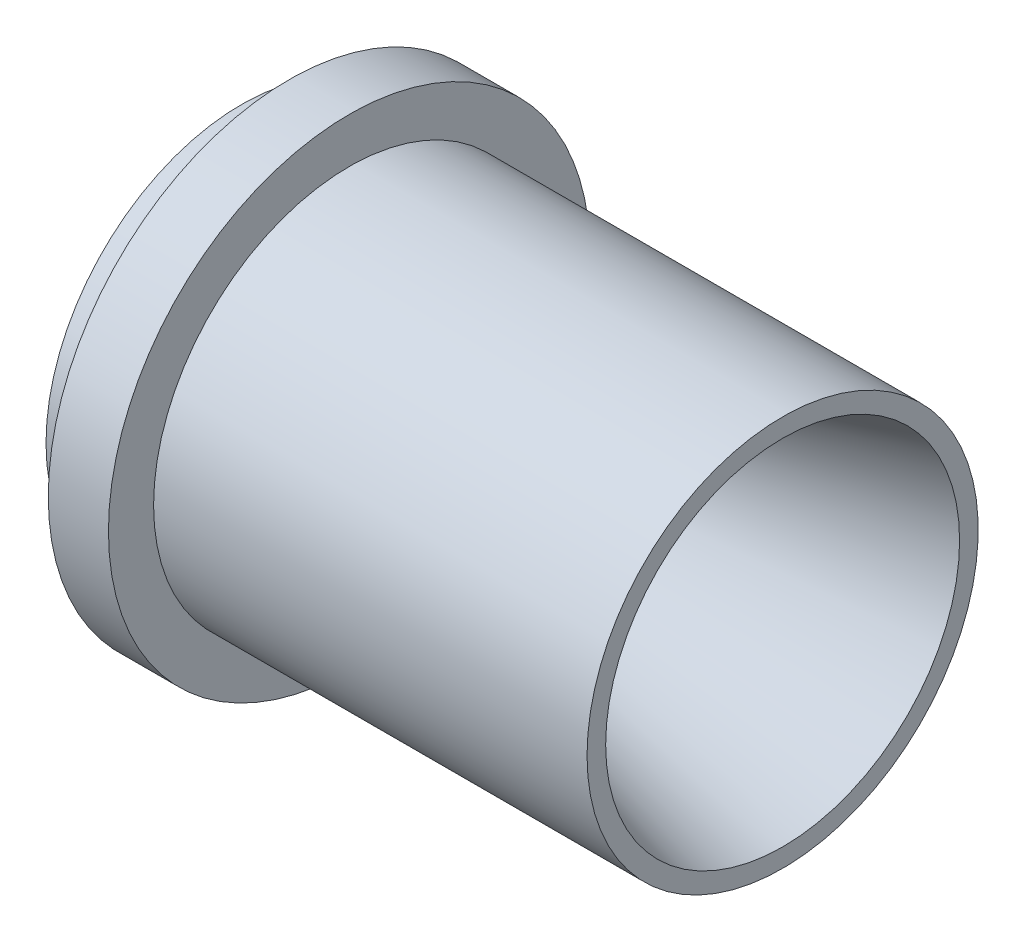
ISO-10303-21;
HEADER;
FILE_DESCRIPTION(('STEP AP214'),'2;1');
FILE_NAME('part.step','',(''),(''),'','','');
FILE_SCHEMA(('AUTOMOTIVE_DESIGN { 1 0 10303 214 1 1 1 1 }'));
ENDSEC;
DATA;
#1=APPLICATION_CONTEXT('core data for automotive mechanical design processes');
#2=APPLICATION_PROTOCOL_DEFINITION('international standard','automotive_design',2000,#1);
#3=PRODUCT_CONTEXT('',#1,'mechanical');
#4=PRODUCT('Part','Part','',(#3));
#5=PRODUCT_RELATED_PRODUCT_CATEGORY('part','',(#4));
#6=PRODUCT_DEFINITION_FORMATION('','',#4);
#7=PRODUCT_DEFINITION_CONTEXT('part definition',#1,'design');
#8=PRODUCT_DEFINITION('design','',#6,#7);
#9=PRODUCT_DEFINITION_SHAPE('','',#8);
#10=(LENGTH_UNIT() NAMED_UNIT(*) SI_UNIT(.MILLI.,.METRE.));
#11=(NAMED_UNIT(*) PLANE_ANGLE_UNIT() SI_UNIT($,.RADIAN.));
#12=(NAMED_UNIT(*) SI_UNIT($,.STERADIAN.) SOLID_ANGLE_UNIT());
#13=UNCERTAINTY_MEASURE_WITH_UNIT(LENGTH_MEASURE(1.E-05),#10,'distance_accuracy_value','');
#14=(GEOMETRIC_REPRESENTATION_CONTEXT(3) GLOBAL_UNCERTAINTY_ASSIGNED_CONTEXT((#13)) GLOBAL_UNIT_ASSIGNED_CONTEXT((#10,
#11,#12)) REPRESENTATION_CONTEXT('',''));
#15=CARTESIAN_POINT('',(0.,0.,0.));
#16=DIRECTION('',(0.,0.,1.));
#17=DIRECTION('',(1.,0.,0.));
#18=AXIS2_PLACEMENT_3D('',#15,#16,#17);
#19=CARTESIAN_POINT('',(0.,0.,0.));
#20=DIRECTION('',(-1.,0.,0.));
#21=DIRECTION('',(0.,0.,1.));
#22=AXIS2_PLACEMENT_3D('',#19,#20,#21);
#23=CYLINDRICAL_SURFACE('',#22,26.);
#24=CARTESIAN_POINT('',(-6.3,0.,0.));
#25=DIRECTION('',(-1.,0.,0.));
#26=DIRECTION('',(0.,0.,1.));
#27=AXIS2_PLACEMENT_3D('',#24,#25,#26);
#28=CIRCLE('',#27,26.);
#29=CARTESIAN_POINT('',(-6.3,0.,26.));
#30=VERTEX_POINT('',#29);
#31=EDGE_CURVE('E10',#30,#30,#28,.T.);
#32=ORIENTED_EDGE('',*,*,#31,.F.);
#33=EDGE_LOOP('',(#32));
#34=FACE_BOUND('',#33,.T.);
#35=CARTESIAN_POINT('',(0.,0.,0.));
#36=DIRECTION('',(-1.,0.,0.));
#37=DIRECTION('',(0.,0.,1.));
#38=AXIS2_PLACEMENT_3D('',#35,#36,#37);
#39=CIRCLE('',#38,26.);
#40=CARTESIAN_POINT('',(0.,0.,26.));
#41=VERTEX_POINT('',#40);
#42=EDGE_CURVE('E67',#41,#41,#39,.T.);
#43=ORIENTED_EDGE('',*,*,#42,.T.);
#44=EDGE_LOOP('',(#43));
#45=FACE_BOUND('',#44,.T.);
#46=ADVANCED_FACE('F36',(#34,#45),#23,.T.);
#47=CARTESIAN_POINT('',(-6.3,0.,0.));
#48=DIRECTION('',(-1.,0.,0.));
#49=DIRECTION('',(0.,0.,1.));
#50=AXIS2_PLACEMENT_3D('',#47,#48,#49);
#51=CONICAL_SURFACE('',#50,26.,0.78539816339745);
#52=CARTESIAN_POINT('',(4.72660171779817,0.,0.));
#53=DIRECTION('',(-1.,0.,0.));
#54=DIRECTION('',(0.,0.,1.));
#55=AXIS2_PLACEMENT_3D('',#52,#53,#54);
#56=CIRCLE('',#55,14.9733982822018);
#57=CARTESIAN_POINT('',(4.72660171779817,0.,14.9733982822018));
#58=VERTEX_POINT('',#57);
#59=EDGE_CURVE('E42',#58,#58,#56,.T.);
#60=ORIENTED_EDGE('',*,*,#59,.F.);
#61=EDGE_LOOP('',(#60));
#62=FACE_BOUND('',#61,.T.);
#63=ORIENTED_EDGE('',*,*,#31,.T.);
#64=EDGE_LOOP('',(#63));
#65=FACE_BOUND('',#64,.T.);
#66=ADVANCED_FACE('F110',(#62,#65),#51,.F.);
#67=CARTESIAN_POINT('',(15.3332034355964,0.,0.));
#68=DIRECTION('',(-1.,0.,0.));
#69=DIRECTION('',(0.,0.,1.));
#70=AXIS2_PLACEMENT_3D('',#67,#68,#69);
#71=TOROIDAL_SURFACE('',#70,25.58,15.);
#72=CARTESIAN_POINT('',(19.2154891121342,0.,0.));
#73=DIRECTION('',(-1.,0.,0.));
#74=DIRECTION('',(0.,0.,1.));
#75=AXIS2_PLACEMENT_3D('',#72,#73,#74);
#76=CIRCLE('',#75,11.091112605664);
#77=CARTESIAN_POINT('',(19.2154891121342,0.,11.091112605664));
#78=VERTEX_POINT('',#77);
#79=EDGE_CURVE('E46',#78,#78,#76,.T.);
#80=ORIENTED_EDGE('',*,*,#79,.F.);
#81=EDGE_LOOP('',(#80));
#82=FACE_BOUND('',#81,.T.);
#83=ORIENTED_EDGE('',*,*,#59,.T.);
#84=EDGE_LOOP('',(#83));
#85=FACE_BOUND('',#84,.T.);
#86=ADVANCED_FACE('F105',(#82,#85),#71,.T.);
#87=CARTESIAN_POINT('',(19.2154891121342,0.,0.));
#88=DIRECTION('',(1.,0.,0.));
#89=DIRECTION('',(0.,0.,-1.));
#90=AXIS2_PLACEMENT_3D('',#87,#88,#89);
#91=CONICAL_SURFACE('',#90,11.091112605664,0.26179938779915);
#92=CARTESIAN_POINT('',(65.6193886033863,0.,0.));
#93=DIRECTION('',(-1.,0.,0.));
#94=DIRECTION('',(0.,0.,1.));
#95=AXIS2_PLACEMENT_3D('',#92,#93,#94);
#96=CIRCLE('',#95,23.525);
#97=CARTESIAN_POINT('',(65.6193886033863,0.,23.525));
#98=VERTEX_POINT('',#97);
#99=EDGE_CURVE('E50',#98,#98,#96,.T.);
#100=ORIENTED_EDGE('',*,*,#99,.F.);
#101=EDGE_LOOP('',(#100));
#102=FACE_BOUND('',#101,.T.);
#103=ORIENTED_EDGE('',*,*,#79,.T.);
#104=EDGE_LOOP('',(#103));
#105=FACE_BOUND('',#104,.T.);
#106=ADVANCED_FACE('F99',(#102,#105),#91,.F.);
#107=CARTESIAN_POINT('',(65.6193886033863,26.,0.));
#108=DIRECTION('',(-1.,0.,0.));
#109=DIRECTION('',(0.,0.,1.));
#110=AXIS2_PLACEMENT_3D('',#107,#108,#109);
#111=PLANE('',#110);
#112=CARTESIAN_POINT('',(65.6193886033863,0.,0.));
#113=DIRECTION('',(-1.,0.,0.));
#114=DIRECTION('',(0.,0.,1.));
#115=AXIS2_PLACEMENT_3D('',#112,#113,#114);
#116=CIRCLE('',#115,26.);
#117=CARTESIAN_POINT('',(65.6193886033863,0.,26.));
#118=VERTEX_POINT('',#117);
#119=EDGE_CURVE('E55',#118,#118,#116,.T.);
#120=ORIENTED_EDGE('',*,*,#119,.F.);
#121=EDGE_LOOP('',(#120));
#122=FACE_BOUND('',#121,.T.);
#123=ORIENTED_EDGE('',*,*,#99,.T.);
#124=EDGE_LOOP('',(#123));
#125=FACE_BOUND('',#124,.T.);
#126=ADVANCED_FACE('F93',(#122,#125),#111,.F.);
#127=CARTESIAN_POINT('',(0.,0.,0.));
#128=DIRECTION('',(-1.,0.,0.));
#129=DIRECTION('',(0.,0.,1.));
#130=AXIS2_PLACEMENT_3D('',#127,#128,#129);
#131=CYLINDRICAL_SURFACE('',#130,26.);
#132=CARTESIAN_POINT('',(8.,0.,0.));
#133=DIRECTION('',(-1.,0.,0.));
#134=DIRECTION('',(0.,0.,1.));
#135=AXIS2_PLACEMENT_3D('',#132,#133,#134);
#136=CIRCLE('',#135,26.);
#137=CARTESIAN_POINT('',(8.,0.,26.));
#138=VERTEX_POINT('',#137);
#139=EDGE_CURVE('E58',#138,#138,#136,.T.);
#140=ORIENTED_EDGE('',*,*,#139,.F.);
#141=EDGE_LOOP('',(#140));
#142=FACE_BOUND('',#141,.T.);
#143=ORIENTED_EDGE('',*,*,#119,.T.);
#144=EDGE_LOOP('',(#143));
#145=FACE_BOUND('',#144,.T.);
#146=ADVANCED_FACE('F87',(#142,#145),#131,.T.);
#147=CARTESIAN_POINT('',(8.,32.,0.));
#148=DIRECTION('',(-1.,0.,0.));
#149=DIRECTION('',(0.,0.,1.));
#150=AXIS2_PLACEMENT_3D('',#147,#148,#149);
#151=PLANE('',#150);
#152=CARTESIAN_POINT('',(8.,0.,0.));
#153=DIRECTION('',(-1.,0.,0.));
#154=DIRECTION('',(0.,0.,1.));
#155=AXIS2_PLACEMENT_3D('',#152,#153,#154);
#156=CIRCLE('',#155,32.);
#157=CARTESIAN_POINT('',(8.,0.,32.));
#158=VERTEX_POINT('',#157);
#159=EDGE_CURVE('E61',#158,#158,#156,.T.);
#160=ORIENTED_EDGE('',*,*,#159,.F.);
#161=EDGE_LOOP('',(#160));
#162=FACE_BOUND('',#161,.T.);
#163=ORIENTED_EDGE('',*,*,#139,.T.);
#164=EDGE_LOOP('',(#163));
#165=FACE_BOUND('',#164,.T.);
#166=ADVANCED_FACE('F81',(#162,#165),#151,.F.);
#167=CARTESIAN_POINT('',(0.,0.,0.));
#168=DIRECTION('',(-1.,0.,0.));
#169=DIRECTION('',(0.,0.,1.));
#170=AXIS2_PLACEMENT_3D('',#167,#168,#169);
#171=CYLINDRICAL_SURFACE('',#170,32.);
#172=CARTESIAN_POINT('',(0.,0.,0.));
#173=DIRECTION('',(-1.,0.,0.));
#174=DIRECTION('',(0.,0.,1.));
#175=AXIS2_PLACEMENT_3D('',#172,#173,#174);
#176=CIRCLE('',#175,32.);
#177=CARTESIAN_POINT('',(0.,0.,32.));
#178=VERTEX_POINT('',#177);
#179=EDGE_CURVE('E64',#178,#178,#176,.T.);
#180=ORIENTED_EDGE('',*,*,#179,.F.);
#181=EDGE_LOOP('',(#180));
#182=FACE_BOUND('',#181,.T.);
#183=ORIENTED_EDGE('',*,*,#159,.T.);
#184=EDGE_LOOP('',(#183));
#185=FACE_BOUND('',#184,.T.);
#186=ADVANCED_FACE('F75',(#182,#185),#171,.T.);
#187=CARTESIAN_POINT('',(0.,26.,0.));
#188=DIRECTION('',(1.,0.,0.));
#189=DIRECTION('',(0.,0.,-1.));
#190=AXIS2_PLACEMENT_3D('',#187,#188,#189);
#191=PLANE('',#190);
#192=ORIENTED_EDGE('',*,*,#42,.F.);
#193=EDGE_LOOP('',(#192));
#194=FACE_BOUND('',#193,.T.);
#195=ORIENTED_EDGE('',*,*,#179,.T.);
#196=EDGE_LOOP('',(#195));
#197=FACE_BOUND('',#196,.T.);
#198=ADVANCED_FACE('F72',(#194,#197),#191,.F.);
#199=CLOSED_SHELL('',(#46,#66,#86,#106,#126,#146,#166,#186,#198));
#200=MANIFOLD_SOLID_BREP('B2',#199);
#201=ADVANCED_BREP_SHAPE_REPRESENTATION('',(#18,#200),#14);
#202=SHAPE_DEFINITION_REPRESENTATION(#9,#201);
ENDSEC;
END-ISO-10303-21;
